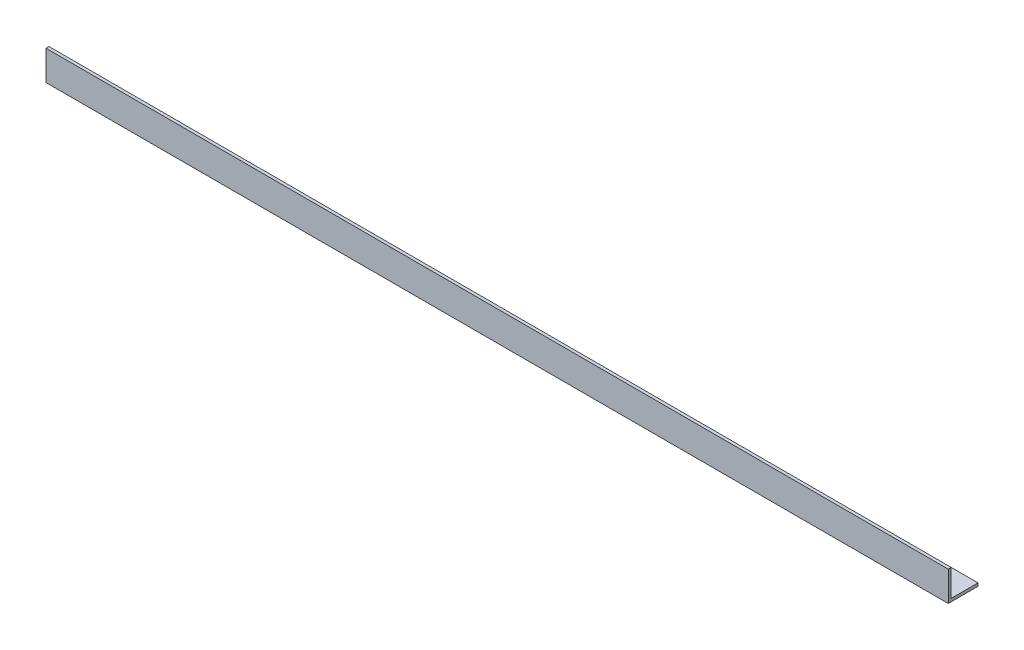
ISO-10303-21;
HEADER;
FILE_DESCRIPTION(('STEP AP214'),'2;1');
FILE_NAME('part.step','',(''),(''),'','','');
FILE_SCHEMA(('AUTOMOTIVE_DESIGN { 1 0 10303 214 1 1 1 1 }'));
ENDSEC;
DATA;
#1=APPLICATION_CONTEXT('core data for automotive mechanical design processes');
#2=APPLICATION_PROTOCOL_DEFINITION('international standard','automotive_design',2000,#1);
#3=PRODUCT_CONTEXT('',#1,'mechanical');
#4=PRODUCT('Part','Part','',(#3));
#5=PRODUCT_RELATED_PRODUCT_CATEGORY('part','',(#4));
#6=PRODUCT_DEFINITION_FORMATION('','',#4);
#7=PRODUCT_DEFINITION_CONTEXT('part definition',#1,'design');
#8=PRODUCT_DEFINITION('design','',#6,#7);
#9=PRODUCT_DEFINITION_SHAPE('','',#8);
#10=(LENGTH_UNIT() NAMED_UNIT(*) SI_UNIT(.MILLI.,.METRE.));
#11=(NAMED_UNIT(*) PLANE_ANGLE_UNIT() SI_UNIT($,.RADIAN.));
#12=(NAMED_UNIT(*) SI_UNIT($,.STERADIAN.) SOLID_ANGLE_UNIT());
#13=UNCERTAINTY_MEASURE_WITH_UNIT(LENGTH_MEASURE(1.E-05),#10,'distance_accuracy_value','');
#14=(GEOMETRIC_REPRESENTATION_CONTEXT(3) GLOBAL_UNCERTAINTY_ASSIGNED_CONTEXT((#13)) GLOBAL_UNIT_ASSIGNED_CONTEXT((#10,
#11,#12)) REPRESENTATION_CONTEXT('',''));
#15=CARTESIAN_POINT('',(0.,0.,0.));
#16=DIRECTION('',(0.,0.,1.));
#17=DIRECTION('',(1.,0.,0.));
#18=AXIS2_PLACEMENT_3D('',#15,#16,#17);
#19=CARTESIAN_POINT('',(455.,0.,-15.));
#20=DIRECTION('',(0.,1.,0.));
#21=DIRECTION('',(0.,0.,1.));
#22=AXIS2_PLACEMENT_3D('',#19,#20,#21);
#23=PLANE('',#22);
#24=DIRECTION('',(0.,0.,-1.));
#25=VECTOR('',#24,1.);
#26=CARTESIAN_POINT('',(0.,0.,-15.));
#27=LINE('',#26,#25);
#28=CARTESIAN_POINT('',(0.,0.,0.));
#29=VERTEX_POINT('',#28);
#30=CARTESIAN_POINT('',(0.,0.,-15.));
#31=VERTEX_POINT('',#30);
#32=EDGE_CURVE('E119',#29,#31,#27,.T.);
#33=ORIENTED_EDGE('',*,*,#32,.T.);
#34=DIRECTION('',(-1.,0.,0.));
#35=VECTOR('',#34,1.);
#36=CARTESIAN_POINT('',(455.,0.,-15.));
#37=LINE('',#36,#35);
#38=CARTESIAN_POINT('',(455.,0.,-15.));
#39=VERTEX_POINT('',#38);
#40=EDGE_CURVE('E11',#39,#31,#37,.T.);
#41=ORIENTED_EDGE('',*,*,#40,.F.);
#42=DIRECTION('',(0.,0.,-1.));
#43=VECTOR('',#42,1.);
#44=CARTESIAN_POINT('',(455.,0.,-15.));
#45=LINE('',#44,#43);
#46=CARTESIAN_POINT('',(455.,0.,0.));
#47=VERTEX_POINT('',#46);
#48=EDGE_CURVE('E129',#47,#39,#45,.T.);
#49=ORIENTED_EDGE('',*,*,#48,.F.);
#50=DIRECTION('',(-1.,0.,0.));
#51=VECTOR('',#50,1.);
#52=CARTESIAN_POINT('',(455.,0.,0.));
#53=LINE('',#52,#51);
#54=EDGE_CURVE('E115',#47,#29,#53,.T.);
#55=ORIENTED_EDGE('',*,*,#54,.T.);
#56=EDGE_LOOP('',(#33,#41,#49,#55));
#57=FACE_BOUND('',#56,.T.);
#58=ADVANCED_FACE('F35',(#57),#23,.F.);
#59=CARTESIAN_POINT('',(455.,1.49999999999998,-15.));
#60=DIRECTION('',(0.,0.,1.));
#61=DIRECTION('',(1.,0.,0.));
#62=AXIS2_PLACEMENT_3D('',#59,#60,#61);
#63=PLANE('',#62);
#64=DIRECTION('',(0.,1.,0.));
#65=VECTOR('',#64,1.);
#66=CARTESIAN_POINT('',(0.,1.49999999999998,-15.));
#67=LINE('',#66,#65);
#68=CARTESIAN_POINT('',(0.,1.49999999999998,-15.));
#69=VERTEX_POINT('',#68);
#70=EDGE_CURVE('E122',#31,#69,#67,.T.);
#71=ORIENTED_EDGE('',*,*,#70,.T.);
#72=DIRECTION('',(-1.,0.,0.));
#73=VECTOR('',#72,1.);
#74=CARTESIAN_POINT('',(455.,1.49999999999998,-15.));
#75=LINE('',#74,#73);
#76=CARTESIAN_POINT('',(455.,1.49999999999998,-15.));
#77=VERTEX_POINT('',#76);
#78=EDGE_CURVE('E43',#77,#69,#75,.T.);
#79=ORIENTED_EDGE('',*,*,#78,.F.);
#80=DIRECTION('',(0.,1.,0.));
#81=VECTOR('',#80,1.);
#82=CARTESIAN_POINT('',(455.,1.49999999999998,-15.));
#83=LINE('',#82,#81);
#84=EDGE_CURVE('E88',#39,#77,#83,.T.);
#85=ORIENTED_EDGE('',*,*,#84,.F.);
#86=ORIENTED_EDGE('',*,*,#40,.T.);
#87=EDGE_LOOP('',(#71,#79,#85,#86));
#88=FACE_BOUND('',#87,.T.);
#89=ADVANCED_FACE('F153',(#88),#63,.F.);
#90=CARTESIAN_POINT('',(455.,1.5,-1.50000000000002));
#91=DIRECTION('',(0.,-1.,0.));
#92=DIRECTION('',(0.,0.,-1.));
#93=AXIS2_PLACEMENT_3D('',#90,#91,#92);
#94=PLANE('',#93);
#95=DIRECTION('',(0.,0.,1.));
#96=VECTOR('',#95,1.);
#97=CARTESIAN_POINT('',(0.,1.5,-1.50000000000002));
#98=LINE('',#97,#96);
#99=CARTESIAN_POINT('',(0.,1.5,-1.50000000000002));
#100=VERTEX_POINT('',#99);
#101=EDGE_CURVE('E124',#69,#100,#98,.T.);
#102=ORIENTED_EDGE('',*,*,#101,.T.);
#103=DIRECTION('',(-1.,0.,0.));
#104=VECTOR('',#103,1.);
#105=CARTESIAN_POINT('',(455.,1.5,-1.50000000000002));
#106=LINE('',#105,#104);
#107=CARTESIAN_POINT('',(455.,1.5,-1.50000000000002));
#108=VERTEX_POINT('',#107);
#109=EDGE_CURVE('E110',#108,#100,#106,.T.);
#110=ORIENTED_EDGE('',*,*,#109,.F.);
#111=DIRECTION('',(0.,0.,1.));
#112=VECTOR('',#111,1.);
#113=CARTESIAN_POINT('',(455.,1.5,-1.50000000000002));
#114=LINE('',#113,#112);
#115=EDGE_CURVE('E101',#77,#108,#114,.T.);
#116=ORIENTED_EDGE('',*,*,#115,.F.);
#117=ORIENTED_EDGE('',*,*,#78,.T.);
#118=EDGE_LOOP('',(#102,#110,#116,#117));
#119=FACE_BOUND('',#118,.T.);
#120=ADVANCED_FACE('F135',(#119),#94,.F.);
#121=CARTESIAN_POINT('',(455.,15.,-1.5));
#122=DIRECTION('',(0.,0.,1.));
#123=DIRECTION('',(0.,-1.,0.));
#124=AXIS2_PLACEMENT_3D('',#121,#122,#123);
#125=PLANE('',#124);
#126=DIRECTION('',(0.,1.,0.));
#127=VECTOR('',#126,1.);
#128=CARTESIAN_POINT('',(0.,15.,-1.5));
#129=LINE('',#128,#127);
#130=CARTESIAN_POINT('',(0.,15.,-1.5));
#131=VERTEX_POINT('',#130);
#132=EDGE_CURVE('E109',#100,#131,#129,.T.);
#133=ORIENTED_EDGE('',*,*,#132,.T.);
#134=DIRECTION('',(-1.,0.,0.));
#135=VECTOR('',#134,1.);
#136=CARTESIAN_POINT('',(455.,15.,-1.5));
#137=LINE('',#136,#135);
#138=CARTESIAN_POINT('',(455.,15.,-1.5));
#139=VERTEX_POINT('',#138);
#140=EDGE_CURVE('E106',#139,#131,#137,.T.);
#141=ORIENTED_EDGE('',*,*,#140,.F.);
#142=DIRECTION('',(0.,1.,0.));
#143=VECTOR('',#142,1.);
#144=CARTESIAN_POINT('',(455.,15.,-1.5));
#145=LINE('',#144,#143);
#146=EDGE_CURVE('E95',#108,#139,#145,.T.);
#147=ORIENTED_EDGE('',*,*,#146,.F.);
#148=ORIENTED_EDGE('',*,*,#109,.T.);
#149=EDGE_LOOP('',(#133,#141,#147,#148));
#150=FACE_BOUND('',#149,.T.);
#151=ADVANCED_FACE('F107',(#150),#125,.F.);
#152=CARTESIAN_POINT('',(455.,15.,0.));
#153=DIRECTION('',(0.,-1.,0.));
#154=DIRECTION('',(0.,0.,-1.));
#155=AXIS2_PLACEMENT_3D('',#152,#153,#154);
#156=PLANE('',#155);
#157=DIRECTION('',(0.,0.,1.));
#158=VECTOR('',#157,1.);
#159=CARTESIAN_POINT('',(0.,15.,0.));
#160=LINE('',#159,#158);
#161=CARTESIAN_POINT('',(0.,15.,0.));
#162=VERTEX_POINT('',#161);
#163=EDGE_CURVE('E74',#131,#162,#160,.T.);
#164=ORIENTED_EDGE('',*,*,#163,.T.);
#165=DIRECTION('',(-1.,0.,0.));
#166=VECTOR('',#165,1.);
#167=CARTESIAN_POINT('',(455.,15.,0.));
#168=LINE('',#167,#166);
#169=CARTESIAN_POINT('',(455.,15.,0.));
#170=VERTEX_POINT('',#169);
#171=EDGE_CURVE('E111',#170,#162,#168,.T.);
#172=ORIENTED_EDGE('',*,*,#171,.F.);
#173=DIRECTION('',(0.,0.,1.));
#174=VECTOR('',#173,1.);
#175=CARTESIAN_POINT('',(455.,15.,0.));
#176=LINE('',#175,#174);
#177=EDGE_CURVE('E99',#139,#170,#176,.T.);
#178=ORIENTED_EDGE('',*,*,#177,.F.);
#179=ORIENTED_EDGE('',*,*,#140,.T.);
#180=EDGE_LOOP('',(#164,#172,#178,#179));
#181=FACE_BOUND('',#180,.T.);
#182=ADVANCED_FACE('F113',(#181),#156,.F.);
#183=CARTESIAN_POINT('',(455.,0.,0.));
#184=DIRECTION('',(0.,0.,-1.));
#185=DIRECTION('',(-1.,0.,0.));
#186=AXIS2_PLACEMENT_3D('',#183,#184,#185);
#187=PLANE('',#186);
#188=DIRECTION('',(0.,-1.,0.));
#189=VECTOR('',#188,1.);
#190=CARTESIAN_POINT('',(0.,0.,0.));
#191=LINE('',#190,#189);
#192=EDGE_CURVE('E80',#162,#29,#191,.T.);
#193=ORIENTED_EDGE('',*,*,#192,.T.);
#194=ORIENTED_EDGE('',*,*,#54,.F.);
#195=DIRECTION('',(0.,-1.,0.));
#196=VECTOR('',#195,1.);
#197=CARTESIAN_POINT('',(455.,0.,0.));
#198=LINE('',#197,#196);
#199=EDGE_CURVE('E51',#170,#47,#198,.T.);
#200=ORIENTED_EDGE('',*,*,#199,.F.);
#201=ORIENTED_EDGE('',*,*,#171,.T.);
#202=EDGE_LOOP('',(#193,#194,#200,#201));
#203=FACE_BOUND('',#202,.T.);
#204=ADVANCED_FACE('F142',(#203),#187,.F.);
#205=CARTESIAN_POINT('',(455.,0.,0.));
#206=DIRECTION('',(-1.,0.,0.));
#207=DIRECTION('',(0.,0.,1.));
#208=AXIS2_PLACEMENT_3D('',#205,#206,#207);
#209=PLANE('',#208);
#210=ORIENTED_EDGE('',*,*,#48,.T.);
#211=ORIENTED_EDGE('',*,*,#84,.T.);
#212=ORIENTED_EDGE('',*,*,#115,.T.);
#213=ORIENTED_EDGE('',*,*,#146,.T.);
#214=ORIENTED_EDGE('',*,*,#177,.T.);
#215=ORIENTED_EDGE('',*,*,#199,.T.);
#216=EDGE_LOOP('',(#210,#211,#212,#213,#214,#215));
#217=FACE_BOUND('',#216,.T.);
#218=ADVANCED_FACE('F97',(#217),#209,.F.);
#219=CARTESIAN_POINT('',(0.,0.,0.));
#220=DIRECTION('',(-1.,0.,0.));
#221=DIRECTION('',(0.,0.,1.));
#222=AXIS2_PLACEMENT_3D('',#219,#220,#221);
#223=PLANE('',#222);
#224=ORIENTED_EDGE('',*,*,#32,.F.);
#225=ORIENTED_EDGE('',*,*,#192,.F.);
#226=ORIENTED_EDGE('',*,*,#163,.F.);
#227=ORIENTED_EDGE('',*,*,#132,.F.);
#228=ORIENTED_EDGE('',*,*,#101,.F.);
#229=ORIENTED_EDGE('',*,*,#70,.F.);
#230=EDGE_LOOP('',(#224,#225,#226,#227,#228,#229));
#231=FACE_BOUND('',#230,.T.);
#232=ADVANCED_FACE('F138',(#231),#223,.T.);
#233=CLOSED_SHELL('',(#58,#89,#120,#151,#182,#204,#218,#232));
#234=MANIFOLD_SOLID_BREP('B2',#233);
#235=ADVANCED_BREP_SHAPE_REPRESENTATION('',(#18,#234),#14);
#236=SHAPE_DEFINITION_REPRESENTATION(#9,#235);
ENDSEC;
END-ISO-10303-21;
